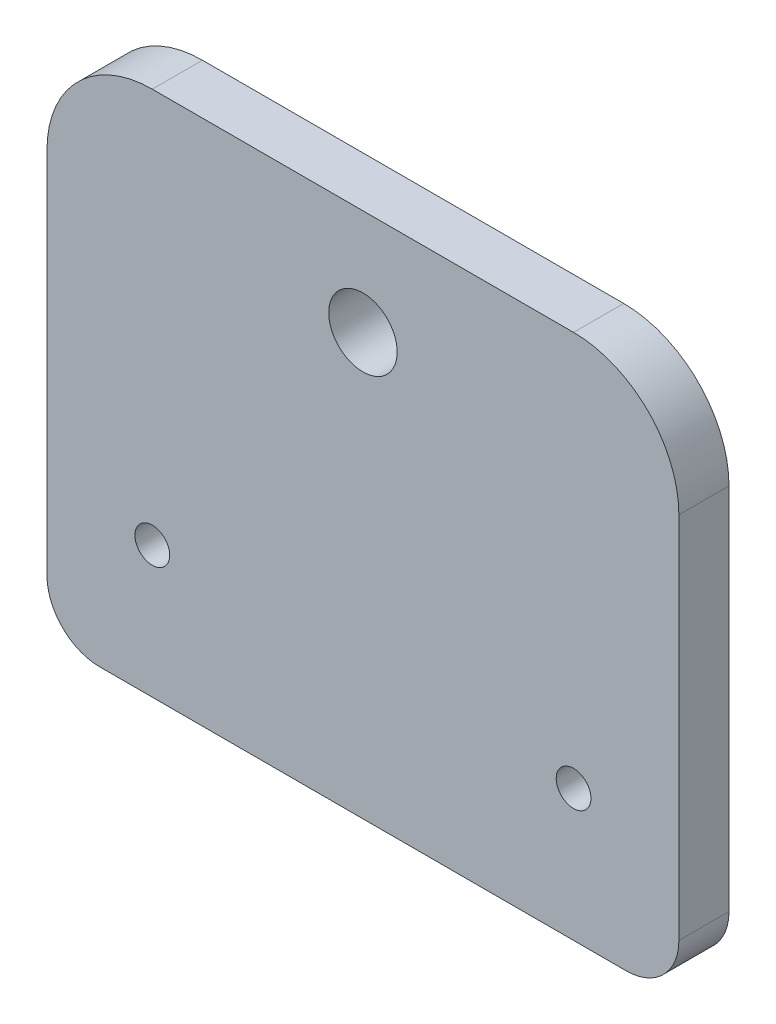
ISO-10303-21;
HEADER;
FILE_DESCRIPTION(('STEP AP214'),'2;1');
FILE_NAME('part.step','',(''),(''),'','','');
FILE_SCHEMA(('AUTOMOTIVE_DESIGN { 1 0 10303 214 1 1 1 1 }'));
ENDSEC;
DATA;
#1=APPLICATION_CONTEXT('core data for automotive mechanical design processes');
#2=APPLICATION_PROTOCOL_DEFINITION('international standard','automotive_design',2000,#1);
#3=PRODUCT_CONTEXT('',#1,'mechanical');
#4=PRODUCT('Part','Part','',(#3));
#5=PRODUCT_RELATED_PRODUCT_CATEGORY('part','',(#4));
#6=PRODUCT_DEFINITION_FORMATION('','',#4);
#7=PRODUCT_DEFINITION_CONTEXT('part definition',#1,'design');
#8=PRODUCT_DEFINITION('design','',#6,#7);
#9=PRODUCT_DEFINITION_SHAPE('','',#8);
#10=(LENGTH_UNIT() NAMED_UNIT(*) SI_UNIT(.MILLI.,.METRE.));
#11=(NAMED_UNIT(*) PLANE_ANGLE_UNIT() SI_UNIT($,.RADIAN.));
#12=(NAMED_UNIT(*) SI_UNIT($,.STERADIAN.) SOLID_ANGLE_UNIT());
#13=UNCERTAINTY_MEASURE_WITH_UNIT(LENGTH_MEASURE(1.E-05),#10,'distance_accuracy_value','');
#14=(GEOMETRIC_REPRESENTATION_CONTEXT(3) GLOBAL_UNCERTAINTY_ASSIGNED_CONTEXT((#13)) GLOBAL_UNIT_ASSIGNED_CONTEXT((#10,
#11,#12)) REPRESENTATION_CONTEXT('',''));
#15=CARTESIAN_POINT('',(0.,0.,0.));
#16=DIRECTION('',(0.,0.,1.));
#17=DIRECTION('',(1.,0.,0.));
#18=AXIS2_PLACEMENT_3D('',#15,#16,#17);
#19=CARTESIAN_POINT('',(0.,0.,4.76));
#20=DIRECTION('',(1.,0.,0.));
#21=DIRECTION('',(0.,0.,-1.));
#22=AXIS2_PLACEMENT_3D('',#19,#20,#21);
#23=PLANE('',#22);
#24=DIRECTION('',(0.,-1.,0.));
#25=VECTOR('',#24,1.);
#26=CARTESIAN_POINT('',(0.,0.,0.));
#27=LINE('',#26,#25);
#28=CARTESIAN_POINT('',(0.,40.,0.));
#29=VERTEX_POINT('',#28);
#30=CARTESIAN_POINT('',(0.,5.,0.));
#31=VERTEX_POINT('',#30);
#32=EDGE_CURVE('E176',#29,#31,#27,.T.);
#33=ORIENTED_EDGE('',*,*,#32,.T.);
#34=DIRECTION('',(0.,0.,-1.));
#35=VECTOR('',#34,1.);
#36=CARTESIAN_POINT('',(0.,5.,4.76));
#37=LINE('',#36,#35);
#38=CARTESIAN_POINT('',(0.,5.,4.76));
#39=VERTEX_POINT('',#38);
#40=EDGE_CURVE('E11',#31,#39,#37,.F.);
#41=ORIENTED_EDGE('',*,*,#40,.T.);
#42=DIRECTION('',(0.,-1.,0.));
#43=VECTOR('',#42,1.);
#44=CARTESIAN_POINT('',(0.,0.,4.76));
#45=LINE('',#44,#43);
#46=CARTESIAN_POINT('',(0.,40.,4.76));
#47=VERTEX_POINT('',#46);
#48=EDGE_CURVE('E131',#47,#39,#45,.T.);
#49=ORIENTED_EDGE('',*,*,#48,.F.);
#50=DIRECTION('',(0.,0.,-1.));
#51=VECTOR('',#50,1.);
#52=CARTESIAN_POINT('',(0.,40.,4.76));
#53=LINE('',#52,#51);
#54=EDGE_CURVE('E147',#47,#29,#53,.T.);
#55=ORIENTED_EDGE('',*,*,#54,.T.);
#56=EDGE_LOOP('',(#33,#41,#49,#55));
#57=FACE_BOUND('',#56,.T.);
#58=ADVANCED_FACE('F39',(#57),#23,.F.);
#59=CARTESIAN_POINT('',(0.,0.,4.76));
#60=DIRECTION('',(0.,1.,0.));
#61=DIRECTION('',(0.,0.,1.));
#62=AXIS2_PLACEMENT_3D('',#59,#60,#61);
#63=PLANE('',#62);
#64=DIRECTION('',(1.,0.,0.));
#65=VECTOR('',#64,1.);
#66=CARTESIAN_POINT('',(0.,0.,0.));
#67=LINE('',#66,#65);
#68=CARTESIAN_POINT('',(5.,0.,0.));
#69=VERTEX_POINT('',#68);
#70=CARTESIAN_POINT('',(55.,0.,0.));
#71=VERTEX_POINT('',#70);
#72=EDGE_CURVE('E136',#69,#71,#67,.T.);
#73=ORIENTED_EDGE('',*,*,#72,.T.);
#74=DIRECTION('',(0.,0.,-1.));
#75=VECTOR('',#74,1.);
#76=CARTESIAN_POINT('',(55.,0.,4.76));
#77=LINE('',#76,#75);
#78=CARTESIAN_POINT('',(55.,0.,4.76));
#79=VERTEX_POINT('',#78);
#80=EDGE_CURVE('E60',#71,#79,#77,.F.);
#81=ORIENTED_EDGE('',*,*,#80,.T.);
#82=DIRECTION('',(1.,0.,0.));
#83=VECTOR('',#82,1.);
#84=CARTESIAN_POINT('',(0.,0.,4.76));
#85=LINE('',#84,#83);
#86=CARTESIAN_POINT('',(5.,0.,4.76));
#87=VERTEX_POINT('',#86);
#88=EDGE_CURVE('E134',#87,#79,#85,.T.);
#89=ORIENTED_EDGE('',*,*,#88,.F.);
#90=DIRECTION('',(0.,0.,-1.));
#91=VECTOR('',#90,1.);
#92=CARTESIAN_POINT('',(5.,0.,4.76));
#93=LINE('',#92,#91);
#94=EDGE_CURVE('E157',#87,#69,#93,.T.);
#95=ORIENTED_EDGE('',*,*,#94,.T.);
#96=EDGE_LOOP('',(#73,#81,#89,#95));
#97=FACE_BOUND('',#96,.T.);
#98=ADVANCED_FACE('F174',(#97),#63,.F.);
#99=CARTESIAN_POINT('',(60.,0.,4.76));
#100=DIRECTION('',(-1.,0.,0.));
#101=DIRECTION('',(0.,0.,1.));
#102=AXIS2_PLACEMENT_3D('',#99,#100,#101);
#103=PLANE('',#102);
#104=DIRECTION('',(0.,1.,0.));
#105=VECTOR('',#104,1.);
#106=CARTESIAN_POINT('',(60.,0.,4.76));
#107=LINE('',#106,#105);
#108=CARTESIAN_POINT('',(60.,5.,4.76));
#109=VERTEX_POINT('',#108);
#110=CARTESIAN_POINT('',(60.,40.,4.76));
#111=VERTEX_POINT('',#110);
#112=EDGE_CURVE('E166',#109,#111,#107,.T.);
#113=ORIENTED_EDGE('',*,*,#112,.F.);
#114=DIRECTION('',(0.,0.,-1.));
#115=VECTOR('',#114,1.);
#116=CARTESIAN_POINT('',(60.,5.,4.76));
#117=LINE('',#116,#115);
#118=CARTESIAN_POINT('',(60.,5.,0.));
#119=VERTEX_POINT('',#118);
#120=EDGE_CURVE('E150',#109,#119,#117,.T.);
#121=ORIENTED_EDGE('',*,*,#120,.T.);
#122=DIRECTION('',(0.,1.,0.));
#123=VECTOR('',#122,1.);
#124=CARTESIAN_POINT('',(60.,0.,0.));
#125=LINE('',#124,#123);
#126=CARTESIAN_POINT('',(60.,40.,0.));
#127=VERTEX_POINT('',#126);
#128=EDGE_CURVE('E132',#119,#127,#125,.T.);
#129=ORIENTED_EDGE('',*,*,#128,.T.);
#130=DIRECTION('',(0.,0.,-1.));
#131=VECTOR('',#130,1.);
#132=CARTESIAN_POINT('',(60.,40.,4.76));
#133=LINE('',#132,#131);
#134=EDGE_CURVE('E113',#127,#111,#133,.F.);
#135=ORIENTED_EDGE('',*,*,#134,.T.);
#136=EDGE_LOOP('',(#113,#121,#129,#135));
#137=FACE_BOUND('',#136,.T.);
#138=ADVANCED_FACE('F170',(#137),#103,.F.);
#139=CARTESIAN_POINT('',(0.,50.,4.76));
#140=DIRECTION('',(0.,-1.,0.));
#141=DIRECTION('',(0.,0.,-1.));
#142=AXIS2_PLACEMENT_3D('',#139,#140,#141);
#143=PLANE('',#142);
#144=DIRECTION('',(-1.,0.,0.));
#145=VECTOR('',#144,1.);
#146=CARTESIAN_POINT('',(0.,50.,4.76));
#147=LINE('',#146,#145);
#148=CARTESIAN_POINT('',(50.,50.,4.76));
#149=VERTEX_POINT('',#148);
#150=CARTESIAN_POINT('',(10.,50.,4.76));
#151=VERTEX_POINT('',#150);
#152=EDGE_CURVE('E126',#149,#151,#147,.T.);
#153=ORIENTED_EDGE('',*,*,#152,.F.);
#154=DIRECTION('',(0.,0.,-1.));
#155=VECTOR('',#154,1.);
#156=CARTESIAN_POINT('',(50.,50.,4.76));
#157=LINE('',#156,#155);
#158=CARTESIAN_POINT('',(50.,50.,0.));
#159=VERTEX_POINT('',#158);
#160=EDGE_CURVE('E111',#149,#159,#157,.T.);
#161=ORIENTED_EDGE('',*,*,#160,.T.);
#162=DIRECTION('',(-1.,0.,0.));
#163=VECTOR('',#162,1.);
#164=CARTESIAN_POINT('',(0.,50.,0.));
#165=LINE('',#164,#163);
#166=CARTESIAN_POINT('',(10.,50.,0.));
#167=VERTEX_POINT('',#166);
#168=EDGE_CURVE('E123',#159,#167,#165,.T.);
#169=ORIENTED_EDGE('',*,*,#168,.T.);
#170=DIRECTION('',(0.,0.,-1.));
#171=VECTOR('',#170,1.);
#172=CARTESIAN_POINT('',(10.,50.,4.76));
#173=LINE('',#172,#171);
#174=EDGE_CURVE('E127',#167,#151,#173,.F.);
#175=ORIENTED_EDGE('',*,*,#174,.T.);
#176=EDGE_LOOP('',(#153,#161,#169,#175));
#177=FACE_BOUND('',#176,.T.);
#178=ADVANCED_FACE('F122',(#177),#143,.F.);
#179=CARTESIAN_POINT('',(0.,0.,4.76));
#180=DIRECTION('',(0.,0.,-1.));
#181=DIRECTION('',(-1.,0.,0.));
#182=AXIS2_PLACEMENT_3D('',#179,#180,#181);
#183=PLANE('',#182);
#184=CARTESIAN_POINT('',(10.,12.5,4.76));
#185=DIRECTION('',(0.,0.,1.));
#186=DIRECTION('',(1.,0.,0.));
#187=AXIS2_PLACEMENT_3D('',#184,#185,#186);
#188=CIRCLE('',#187,1.65);
#189=CARTESIAN_POINT('',(11.65,12.5,4.76));
#190=VERTEX_POINT('',#189);
#191=EDGE_CURVE('E194',#190,#190,#188,.T.);
#192=ORIENTED_EDGE('',*,*,#191,.F.);
#193=EDGE_LOOP('',(#192));
#194=FACE_BOUND('',#193,.T.);
#195=CARTESIAN_POINT('',(50.,12.5,4.76));
#196=DIRECTION('',(0.,0.,1.));
#197=DIRECTION('',(-1.,0.,0.));
#198=AXIS2_PLACEMENT_3D('',#195,#196,#197);
#199=CIRCLE('',#198,1.65);
#200=CARTESIAN_POINT('',(48.35,12.5,4.76));
#201=VERTEX_POINT('',#200);
#202=EDGE_CURVE('E191',#201,#201,#199,.T.);
#203=ORIENTED_EDGE('',*,*,#202,.F.);
#204=EDGE_LOOP('',(#203));
#205=FACE_BOUND('',#204,.T.);
#206=CARTESIAN_POINT('',(30.,40.,4.76));
#207=DIRECTION('',(0.,0.,1.));
#208=DIRECTION('',(1.,0.,0.));
#209=AXIS2_PLACEMENT_3D('',#206,#207,#208);
#210=CIRCLE('',#209,3.25);
#211=CARTESIAN_POINT('',(33.25,40.,4.76));
#212=VERTEX_POINT('',#211);
#213=EDGE_CURVE('E185',#212,#212,#210,.T.);
#214=ORIENTED_EDGE('',*,*,#213,.F.);
#215=EDGE_LOOP('',(#214));
#216=FACE_BOUND('',#215,.T.);
#217=ORIENTED_EDGE('',*,*,#88,.T.);
#218=CARTESIAN_POINT('',(55.,5.,4.76));
#219=DIRECTION('',(0.,0.,-1.));
#220=DIRECTION('',(-1.,0.,0.));
#221=AXIS2_PLACEMENT_3D('',#218,#219,#220);
#222=CIRCLE('',#221,5.);
#223=EDGE_CURVE('E47',#79,#109,#222,.F.);
#224=ORIENTED_EDGE('',*,*,#223,.T.);
#225=ORIENTED_EDGE('',*,*,#112,.T.);
#226=CARTESIAN_POINT('',(50.,40.,4.76));
#227=DIRECTION('',(0.,0.,-1.));
#228=DIRECTION('',(-1.,0.,0.));
#229=AXIS2_PLACEMENT_3D('',#226,#227,#228);
#230=CIRCLE('',#229,10.);
#231=EDGE_CURVE('E145',#111,#149,#230,.F.);
#232=ORIENTED_EDGE('',*,*,#231,.T.);
#233=ORIENTED_EDGE('',*,*,#152,.T.);
#234=CARTESIAN_POINT('',(10.,40.,4.76));
#235=DIRECTION('',(0.,0.,-1.));
#236=DIRECTION('',(-1.,0.,0.));
#237=AXIS2_PLACEMENT_3D('',#234,#235,#236);
#238=CIRCLE('',#237,10.);
#239=EDGE_CURVE('E143',#151,#47,#238,.F.);
#240=ORIENTED_EDGE('',*,*,#239,.T.);
#241=ORIENTED_EDGE('',*,*,#48,.T.);
#242=CARTESIAN_POINT('',(5.,5.,4.76));
#243=DIRECTION('',(0.,0.,-1.));
#244=DIRECTION('',(-1.,0.,0.));
#245=AXIS2_PLACEMENT_3D('',#242,#243,#244);
#246=CIRCLE('',#245,5.);
#247=EDGE_CURVE('E161',#39,#87,#246,.F.);
#248=ORIENTED_EDGE('',*,*,#247,.T.);
#249=EDGE_LOOP('',(#217,#224,#225,#232,#233,#240,#241,#248));
#250=FACE_BOUND('',#249,.T.);
#251=ADVANCED_FACE('F165',(#194,#205,#216,#250),#183,.F.);
#252=CARTESIAN_POINT('',(0.,0.,0.));
#253=DIRECTION('',(0.,0.,-1.));
#254=DIRECTION('',(-1.,0.,0.));
#255=AXIS2_PLACEMENT_3D('',#252,#253,#254);
#256=PLANE('',#255);
#257=CARTESIAN_POINT('',(10.,12.5,0.));
#258=DIRECTION('',(0.,0.,1.));
#259=DIRECTION('',(1.,0.,0.));
#260=AXIS2_PLACEMENT_3D('',#257,#258,#259);
#261=CIRCLE('',#260,1.65);
#262=CARTESIAN_POINT('',(11.65,12.5,0.));
#263=VERTEX_POINT('',#262);
#264=EDGE_CURVE('E177',#263,#263,#261,.T.);
#265=ORIENTED_EDGE('',*,*,#264,.T.);
#266=EDGE_LOOP('',(#265));
#267=FACE_BOUND('',#266,.T.);
#268=CARTESIAN_POINT('',(50.,12.5,0.));
#269=DIRECTION('',(0.,0.,1.));
#270=DIRECTION('',(-1.,0.,0.));
#271=AXIS2_PLACEMENT_3D('',#268,#269,#270);
#272=CIRCLE('',#271,1.65);
#273=CARTESIAN_POINT('',(48.35,12.5,0.));
#274=VERTEX_POINT('',#273);
#275=EDGE_CURVE('E188',#274,#274,#272,.T.);
#276=ORIENTED_EDGE('',*,*,#275,.T.);
#277=EDGE_LOOP('',(#276));
#278=FACE_BOUND('',#277,.T.);
#279=CARTESIAN_POINT('',(30.,40.,0.));
#280=DIRECTION('',(0.,0.,1.));
#281=DIRECTION('',(1.,0.,0.));
#282=AXIS2_PLACEMENT_3D('',#279,#280,#281);
#283=CIRCLE('',#282,3.25);
#284=CARTESIAN_POINT('',(33.25,40.,0.));
#285=VERTEX_POINT('',#284);
#286=EDGE_CURVE('E182',#285,#285,#283,.T.);
#287=ORIENTED_EDGE('',*,*,#286,.T.);
#288=EDGE_LOOP('',(#287));
#289=FACE_BOUND('',#288,.T.);
#290=ORIENTED_EDGE('',*,*,#128,.F.);
#291=CARTESIAN_POINT('',(55.,5.,0.));
#292=DIRECTION('',(0.,0.,-1.));
#293=DIRECTION('',(-1.,0.,0.));
#294=AXIS2_PLACEMENT_3D('',#291,#292,#293);
#295=CIRCLE('',#294,5.);
#296=EDGE_CURVE('E155',#119,#71,#295,.T.);
#297=ORIENTED_EDGE('',*,*,#296,.T.);
#298=ORIENTED_EDGE('',*,*,#72,.F.);
#299=CARTESIAN_POINT('',(5.,5.,0.));
#300=DIRECTION('',(0.,0.,-1.));
#301=DIRECTION('',(-1.,0.,0.));
#302=AXIS2_PLACEMENT_3D('',#299,#300,#301);
#303=CIRCLE('',#302,5.);
#304=EDGE_CURVE('E153',#69,#31,#303,.T.);
#305=ORIENTED_EDGE('',*,*,#304,.T.);
#306=ORIENTED_EDGE('',*,*,#32,.F.);
#307=CARTESIAN_POINT('',(10.,40.,0.));
#308=DIRECTION('',(0.,0.,-1.));
#309=DIRECTION('',(-1.,0.,0.));
#310=AXIS2_PLACEMENT_3D('',#307,#308,#309);
#311=CIRCLE('',#310,10.);
#312=EDGE_CURVE('E117',#29,#167,#311,.T.);
#313=ORIENTED_EDGE('',*,*,#312,.T.);
#314=ORIENTED_EDGE('',*,*,#168,.F.);
#315=CARTESIAN_POINT('',(50.,40.,0.));
#316=DIRECTION('',(0.,0.,-1.));
#317=DIRECTION('',(-1.,0.,0.));
#318=AXIS2_PLACEMENT_3D('',#315,#316,#317);
#319=CIRCLE('',#318,10.);
#320=EDGE_CURVE('E107',#159,#127,#319,.T.);
#321=ORIENTED_EDGE('',*,*,#320,.T.);
#322=EDGE_LOOP('',(#290,#297,#298,#305,#306,#313,#314,#321));
#323=FACE_BOUND('',#322,.T.);
#324=ADVANCED_FACE('F129',(#267,#278,#289,#323),#256,.T.);
#325=CARTESIAN_POINT('',(30.,40.,0.));
#326=DIRECTION('',(0.,0.,1.));
#327=DIRECTION('',(1.,0.,0.));
#328=AXIS2_PLACEMENT_3D('',#325,#326,#327);
#329=CYLINDRICAL_SURFACE('',#328,3.25);
#330=ORIENTED_EDGE('',*,*,#286,.F.);
#331=EDGE_LOOP('',(#330));
#332=FACE_BOUND('',#331,.T.);
#333=ORIENTED_EDGE('',*,*,#213,.T.);
#334=EDGE_LOOP('',(#333));
#335=FACE_BOUND('',#334,.T.);
#336=ADVANCED_FACE('F216',(#332,#335),#329,.F.);
#337=CARTESIAN_POINT('',(50.,12.5,0.));
#338=DIRECTION('',(0.,0.,1.));
#339=DIRECTION('',(1.,0.,0.));
#340=AXIS2_PLACEMENT_3D('',#337,#338,#339);
#341=CYLINDRICAL_SURFACE('',#340,1.65);
#342=ORIENTED_EDGE('',*,*,#275,.F.);
#343=EDGE_LOOP('',(#342));
#344=FACE_BOUND('',#343,.T.);
#345=ORIENTED_EDGE('',*,*,#202,.T.);
#346=EDGE_LOOP('',(#345));
#347=FACE_BOUND('',#346,.T.);
#348=ADVANCED_FACE('F205',(#344,#347),#341,.F.);
#349=CARTESIAN_POINT('',(10.,12.5,0.));
#350=DIRECTION('',(0.,0.,1.));
#351=DIRECTION('',(1.,0.,0.));
#352=AXIS2_PLACEMENT_3D('',#349,#350,#351);
#353=CYLINDRICAL_SURFACE('',#352,1.65);
#354=ORIENTED_EDGE('',*,*,#264,.F.);
#355=EDGE_LOOP('',(#354));
#356=FACE_BOUND('',#355,.T.);
#357=ORIENTED_EDGE('',*,*,#191,.T.);
#358=EDGE_LOOP('',(#357));
#359=FACE_BOUND('',#358,.T.);
#360=ADVANCED_FACE('F202',(#356,#359),#353,.F.);
#361=CARTESIAN_POINT('',(50.,40.,4.76));
#362=DIRECTION('',(0.,0.,-1.));
#363=DIRECTION('',(-1.,0.,0.));
#364=AXIS2_PLACEMENT_3D('',#361,#362,#363);
#365=CYLINDRICAL_SURFACE('',#364,10.);
#366=ORIENTED_EDGE('',*,*,#231,.F.);
#367=ORIENTED_EDGE('',*,*,#134,.F.);
#368=ORIENTED_EDGE('',*,*,#320,.F.);
#369=ORIENTED_EDGE('',*,*,#160,.F.);
#370=EDGE_LOOP('',(#366,#367,#368,#369));
#371=FACE_BOUND('',#370,.T.);
#372=ADVANCED_FACE('F110',(#371),#365,.T.);
#373=CARTESIAN_POINT('',(10.,40.,4.76));
#374=DIRECTION('',(0.,0.,-1.));
#375=DIRECTION('',(-1.,0.,0.));
#376=AXIS2_PLACEMENT_3D('',#373,#374,#375);
#377=CYLINDRICAL_SURFACE('',#376,10.);
#378=ORIENTED_EDGE('',*,*,#239,.F.);
#379=ORIENTED_EDGE('',*,*,#174,.F.);
#380=ORIENTED_EDGE('',*,*,#312,.F.);
#381=ORIENTED_EDGE('',*,*,#54,.F.);
#382=EDGE_LOOP('',(#378,#379,#380,#381));
#383=FACE_BOUND('',#382,.T.);
#384=ADVANCED_FACE('F239',(#383),#377,.T.);
#385=CARTESIAN_POINT('',(55.,5.,4.76));
#386=DIRECTION('',(0.,0.,-1.));
#387=DIRECTION('',(-1.,0.,0.));
#388=AXIS2_PLACEMENT_3D('',#385,#386,#387);
#389=CYLINDRICAL_SURFACE('',#388,5.);
#390=ORIENTED_EDGE('',*,*,#223,.F.);
#391=ORIENTED_EDGE('',*,*,#80,.F.);
#392=ORIENTED_EDGE('',*,*,#296,.F.);
#393=ORIENTED_EDGE('',*,*,#120,.F.);
#394=EDGE_LOOP('',(#390,#391,#392,#393));
#395=FACE_BOUND('',#394,.T.);
#396=ADVANCED_FACE('F172',(#395),#389,.T.);
#397=CARTESIAN_POINT('',(5.,5.,4.76));
#398=DIRECTION('',(0.,0.,-1.));
#399=DIRECTION('',(-1.,0.,0.));
#400=AXIS2_PLACEMENT_3D('',#397,#398,#399);
#401=CYLINDRICAL_SURFACE('',#400,5.);
#402=ORIENTED_EDGE('',*,*,#247,.F.);
#403=ORIENTED_EDGE('',*,*,#40,.F.);
#404=ORIENTED_EDGE('',*,*,#304,.F.);
#405=ORIENTED_EDGE('',*,*,#94,.F.);
#406=EDGE_LOOP('',(#402,#403,#404,#405));
#407=FACE_BOUND('',#406,.T.);
#408=ADVANCED_FACE('F41',(#407),#401,.T.);
#409=CLOSED_SHELL('',(#58,#98,#138,#178,#251,#324,#336,#348,#360,#372,#384,#396,#408));
#410=MANIFOLD_SOLID_BREP('B2',#409);
#411=ADVANCED_BREP_SHAPE_REPRESENTATION('',(#18,#410),#14);
#412=SHAPE_DEFINITION_REPRESENTATION(#9,#411);
ENDSEC;
END-ISO-10303-21;
